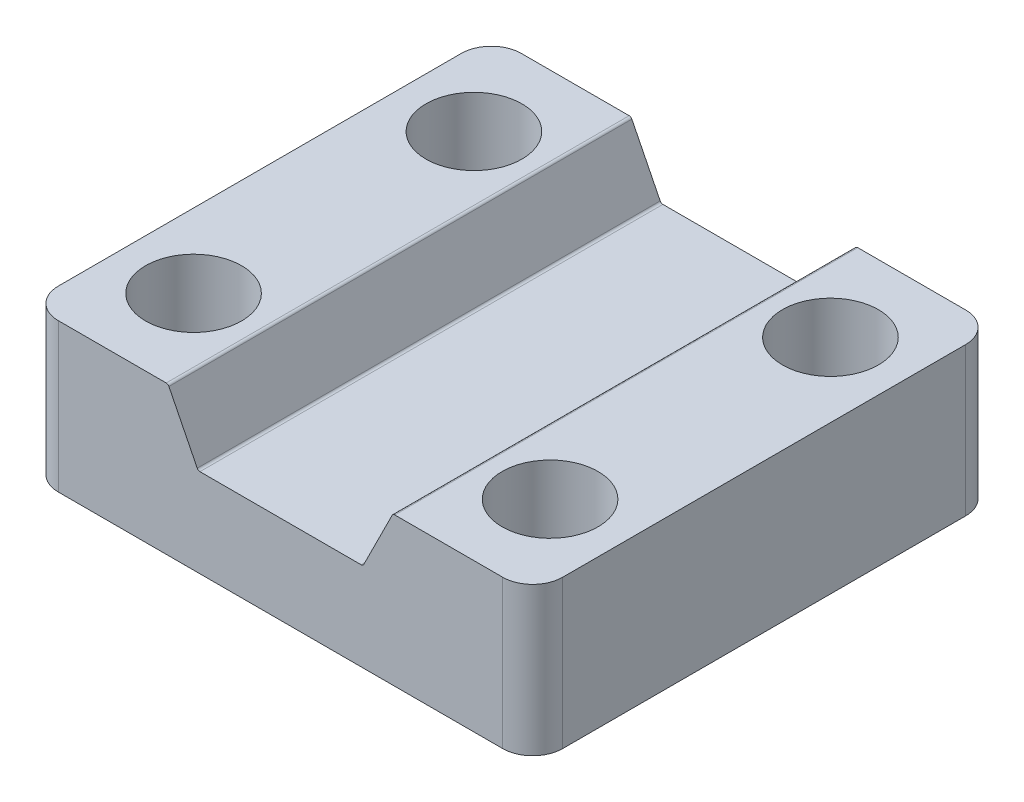
ISO-10303-21;
HEADER;
FILE_DESCRIPTION(('STEP AP214'),'2;1');
FILE_NAME('part.step','',(''),(''),'','','');
FILE_SCHEMA(('AUTOMOTIVE_DESIGN { 1 0 10303 214 1 1 1 1 }'));
ENDSEC;
DATA;
#1=APPLICATION_CONTEXT('core data for automotive mechanical design processes');
#2=APPLICATION_PROTOCOL_DEFINITION('international standard','automotive_design',2000,#1);
#3=PRODUCT_CONTEXT('',#1,'mechanical');
#4=PRODUCT('Part','Part','',(#3));
#5=PRODUCT_RELATED_PRODUCT_CATEGORY('part','',(#4));
#6=PRODUCT_DEFINITION_FORMATION('','',#4);
#7=PRODUCT_DEFINITION_CONTEXT('part definition',#1,'design');
#8=PRODUCT_DEFINITION('design','',#6,#7);
#9=PRODUCT_DEFINITION_SHAPE('','',#8);
#10=(LENGTH_UNIT() NAMED_UNIT(*) SI_UNIT(.MILLI.,.METRE.));
#11=(NAMED_UNIT(*) PLANE_ANGLE_UNIT() SI_UNIT($,.RADIAN.));
#12=(NAMED_UNIT(*) SI_UNIT($,.STERADIAN.) SOLID_ANGLE_UNIT());
#13=UNCERTAINTY_MEASURE_WITH_UNIT(LENGTH_MEASURE(1.E-05),#10,'distance_accuracy_value','');
#14=(GEOMETRIC_REPRESENTATION_CONTEXT(3) GLOBAL_UNCERTAINTY_ASSIGNED_CONTEXT((#13)) GLOBAL_UNIT_ASSIGNED_CONTEXT((#10,
#11,#12)) REPRESENTATION_CONTEXT('',''));
#15=CARTESIAN_POINT('',(0.,0.,0.));
#16=DIRECTION('',(0.,0.,1.));
#17=DIRECTION('',(1.,0.,0.));
#18=AXIS2_PLACEMENT_3D('',#15,#16,#17);
#19=CARTESIAN_POINT('',(0.,12.573,0.));
#20=DIRECTION('',(0.,1.,0.));
#21=DIRECTION('',(0.,0.,1.));
#22=AXIS2_PLACEMENT_3D('',#19,#20,#21);
#23=PLANE('',#22);
#24=DIRECTION('',(0.,0.,-1.));
#25=VECTOR('',#24,1.);
#26=CARTESIAN_POINT('',(21.3614,12.573,-19.6088));
#27=LINE('',#26,#25);
#28=CARTESIAN_POINT('',(21.3614,12.573,17.0688));
#29=VERTEX_POINT('',#28);
#30=CARTESIAN_POINT('',(21.3614,12.573,-17.0688));
#31=VERTEX_POINT('',#30);
#32=EDGE_CURVE('E251',#29,#31,#27,.T.);
#33=ORIENTED_EDGE('',*,*,#32,.T.);
#34=CARTESIAN_POINT('',(18.8214,12.573,-17.0688));
#35=DIRECTION('',(0.,1.,0.));
#36=DIRECTION('',(0.,0.,1.));
#37=AXIS2_PLACEMENT_3D('',#34,#35,#36);
#38=CIRCLE('',#37,2.54);
#39=CARTESIAN_POINT('',(18.8214,12.573,-19.6088));
#40=VERTEX_POINT('',#39);
#41=EDGE_CURVE('E227',#31,#40,#38,.T.);
#42=ORIENTED_EDGE('',*,*,#41,.T.);
#43=DIRECTION('',(-1.,0.,0.));
#44=VECTOR('',#43,1.);
#45=CARTESIAN_POINT('',(-21.3614,12.573,-19.6088));
#46=LINE('',#45,#44);
#47=CARTESIAN_POINT('',(9.68198063314247,12.573,-19.6088));
#48=VERTEX_POINT('',#47);
#49=EDGE_CURVE('E271',#40,#48,#46,.T.);
#50=ORIENTED_EDGE('',*,*,#49,.T.);
#51=DIRECTION('',(0.,0.,1.));
#52=VECTOR('',#51,1.);
#53=CARTESIAN_POINT('',(9.68198063314247,12.573,19.6088));
#54=LINE('',#53,#52);
#55=CARTESIAN_POINT('',(9.68198063314247,12.573,19.6088));
#56=VERTEX_POINT('',#55);
#57=EDGE_CURVE('E184',#48,#56,#54,.T.);
#58=ORIENTED_EDGE('',*,*,#57,.T.);
#59=DIRECTION('',(1.,0.,0.));
#60=VECTOR('',#59,1.);
#61=CARTESIAN_POINT('',(-21.3614,12.573,19.6088));
#62=LINE('',#61,#60);
#63=CARTESIAN_POINT('',(18.8214,12.573,19.6088));
#64=VERTEX_POINT('',#63);
#65=EDGE_CURVE('E294',#56,#64,#62,.T.);
#66=ORIENTED_EDGE('',*,*,#65,.T.);
#67=CARTESIAN_POINT('',(18.8214,12.573,17.0688));
#68=DIRECTION('',(0.,1.,0.));
#69=DIRECTION('',(0.,0.,1.));
#70=AXIS2_PLACEMENT_3D('',#67,#68,#69);
#71=CIRCLE('',#70,2.54);
#72=EDGE_CURVE('E225',#64,#29,#71,.T.);
#73=ORIENTED_EDGE('',*,*,#72,.T.);
#74=EDGE_LOOP('',(#33,#42,#50,#58,#66,#73));
#75=FACE_BOUND('',#74,.T.);
#76=CARTESIAN_POINT('',(15.1003,12.573,11.8745));
#77=DIRECTION('',(0.,1.,0.));
#78=DIRECTION('',(0.,0.,1.));
#79=AXIS2_PLACEMENT_3D('',#76,#77,#78);
#80=CIRCLE('',#79,4.06400000000002);
#81=CARTESIAN_POINT('',(15.1003,12.573,15.9385));
#82=VERTEX_POINT('',#81);
#83=EDGE_CURVE('E287',#82,#82,#80,.T.);
#84=ORIENTED_EDGE('',*,*,#83,.F.);
#85=EDGE_LOOP('',(#84));
#86=FACE_BOUND('',#85,.T.);
#87=CARTESIAN_POINT('',(15.1003,12.573,-11.8745));
#88=DIRECTION('',(0.,1.,0.));
#89=DIRECTION('',(0.,0.,1.));
#90=AXIS2_PLACEMENT_3D('',#87,#88,#89);
#91=CIRCLE('',#90,4.06400000000002);
#92=CARTESIAN_POINT('',(15.1003,12.573,-7.81049999999998));
#93=VERTEX_POINT('',#92);
#94=EDGE_CURVE('E302',#93,#93,#91,.T.);
#95=ORIENTED_EDGE('',*,*,#94,.F.);
#96=EDGE_LOOP('',(#95));
#97=FACE_BOUND('',#96,.T.);
#98=ADVANCED_FACE('F33',(#75,#86,#97),#23,.T.);
#99=CARTESIAN_POINT('',(-9.68198063314247,12.573,-19.6088));
#100=VERTEX_POINT('',#99);
#101=CARTESIAN_POINT('',(-18.8214,12.573,-19.6088));
#102=VERTEX_POINT('',#101);
#103=EDGE_CURVE('E255',#100,#102,#46,.T.);
#104=ORIENTED_EDGE('',*,*,#103,.T.);
#105=CARTESIAN_POINT('',(-18.8214,12.573,-17.0688));
#106=DIRECTION('',(0.,1.,0.));
#107=DIRECTION('',(0.,0.,1.));
#108=AXIS2_PLACEMENT_3D('',#105,#106,#107);
#109=CIRCLE('',#108,2.54);
#110=CARTESIAN_POINT('',(-21.3614,12.573,-17.0688));
#111=VERTEX_POINT('',#110);
#112=EDGE_CURVE('E234',#102,#111,#109,.T.);
#113=ORIENTED_EDGE('',*,*,#112,.T.);
#114=DIRECTION('',(0.,0.,1.));
#115=VECTOR('',#114,1.);
#116=CARTESIAN_POINT('',(-21.3614,12.573,-19.6088));
#117=LINE('',#116,#115);
#118=CARTESIAN_POINT('',(-21.3614,12.573,17.0688));
#119=VERTEX_POINT('',#118);
#120=EDGE_CURVE('E275',#111,#119,#117,.T.);
#121=ORIENTED_EDGE('',*,*,#120,.T.);
#122=CARTESIAN_POINT('',(-18.8214,12.573,17.0688));
#123=DIRECTION('',(0.,1.,0.));
#124=DIRECTION('',(0.,0.,1.));
#125=AXIS2_PLACEMENT_3D('',#122,#123,#124);
#126=CIRCLE('',#125,2.54);
#127=CARTESIAN_POINT('',(-18.8214,12.573,19.6088));
#128=VERTEX_POINT('',#127);
#129=EDGE_CURVE('E48',#119,#128,#126,.T.);
#130=ORIENTED_EDGE('',*,*,#129,.T.);
#131=CARTESIAN_POINT('',(-9.68198063314247,12.573,19.6088));
#132=VERTEX_POINT('',#131);
#133=EDGE_CURVE('E243',#128,#132,#62,.T.);
#134=ORIENTED_EDGE('',*,*,#133,.T.);
#135=DIRECTION('',(0.,0.,1.));
#136=VECTOR('',#135,1.);
#137=CARTESIAN_POINT('',(-9.68198063314247,12.573,-19.6088));
#138=LINE('',#137,#136);
#139=EDGE_CURVE('E201',#132,#100,#138,.F.);
#140=ORIENTED_EDGE('',*,*,#139,.T.);
#141=EDGE_LOOP('',(#104,#113,#121,#130,#134,#140));
#142=FACE_BOUND('',#141,.T.);
#143=CARTESIAN_POINT('',(-15.1003,12.573,-11.8745));
#144=DIRECTION('',(0.,1.,0.));
#145=DIRECTION('',(0.,0.,1.));
#146=AXIS2_PLACEMENT_3D('',#143,#144,#145);
#147=CIRCLE('',#146,4.06400000000002);
#148=CARTESIAN_POINT('',(-15.1003,12.573,-7.81049999999998));
#149=VERTEX_POINT('',#148);
#150=EDGE_CURVE('E297',#149,#149,#147,.T.);
#151=ORIENTED_EDGE('',*,*,#150,.F.);
#152=EDGE_LOOP('',(#151));
#153=FACE_BOUND('',#152,.T.);
#154=CARTESIAN_POINT('',(-15.1003,12.573,11.8745));
#155=DIRECTION('',(0.,1.,0.));
#156=DIRECTION('',(0.,0.,1.));
#157=AXIS2_PLACEMENT_3D('',#154,#155,#156);
#158=CIRCLE('',#157,4.06400000000002);
#159=CARTESIAN_POINT('',(-15.1003,12.573,15.9385));
#160=VERTEX_POINT('',#159);
#161=EDGE_CURVE('E308',#160,#160,#158,.T.);
#162=ORIENTED_EDGE('',*,*,#161,.F.);
#163=EDGE_LOOP('',(#162));
#164=FACE_BOUND('',#163,.T.);
#165=ADVANCED_FACE('F336',(#142,#153,#164),#23,.T.);
#166=CARTESIAN_POINT('',(0.,0.,0.));
#167=DIRECTION('',(0.,1.,0.));
#168=DIRECTION('',(0.,0.,1.));
#169=AXIS2_PLACEMENT_3D('',#166,#167,#168);
#170=PLANE('',#169);
#171=DIRECTION('',(-1.,0.,0.));
#172=VECTOR('',#171,1.);
#173=CARTESIAN_POINT('',(-21.3614,0.,-19.6088));
#174=LINE('',#173,#172);
#175=CARTESIAN_POINT('',(18.8214,0.,-19.6088));
#176=VERTEX_POINT('',#175);
#177=CARTESIAN_POINT('',(-18.8214,0.,-19.6088));
#178=VERTEX_POINT('',#177);
#179=EDGE_CURVE('E257',#176,#178,#174,.T.);
#180=ORIENTED_EDGE('',*,*,#179,.F.);
#181=CARTESIAN_POINT('',(18.8214,0.,-17.0688));
#182=DIRECTION('',(0.,1.,0.));
#183=DIRECTION('',(0.,0.,1.));
#184=AXIS2_PLACEMENT_3D('',#181,#182,#183);
#185=CIRCLE('',#184,2.54);
#186=CARTESIAN_POINT('',(21.3614,0.,-17.0688));
#187=VERTEX_POINT('',#186);
#188=EDGE_CURVE('E218',#176,#187,#185,.F.);
#189=ORIENTED_EDGE('',*,*,#188,.T.);
#190=DIRECTION('',(0.,0.,-1.));
#191=VECTOR('',#190,1.);
#192=CARTESIAN_POINT('',(21.3614,0.,-19.6088));
#193=LINE('',#192,#191);
#194=CARTESIAN_POINT('',(21.3614,0.,17.0688));
#195=VERTEX_POINT('',#194);
#196=EDGE_CURVE('E282',#195,#187,#193,.T.);
#197=ORIENTED_EDGE('',*,*,#196,.F.);
#198=CARTESIAN_POINT('',(18.8214,0.,17.0688));
#199=DIRECTION('',(0.,1.,0.));
#200=DIRECTION('',(0.,0.,1.));
#201=AXIS2_PLACEMENT_3D('',#198,#199,#200);
#202=CIRCLE('',#201,2.54);
#203=CARTESIAN_POINT('',(18.8214,0.,19.6088));
#204=VERTEX_POINT('',#203);
#205=EDGE_CURVE('E214',#195,#204,#202,.F.);
#206=ORIENTED_EDGE('',*,*,#205,.T.);
#207=DIRECTION('',(1.,0.,0.));
#208=VECTOR('',#207,1.);
#209=CARTESIAN_POINT('',(-21.3614,0.,19.6088));
#210=LINE('',#209,#208);
#211=CARTESIAN_POINT('',(-18.8214,0.,19.6088));
#212=VERTEX_POINT('',#211);
#213=EDGE_CURVE('E241',#212,#204,#210,.T.);
#214=ORIENTED_EDGE('',*,*,#213,.F.);
#215=CARTESIAN_POINT('',(-18.8214,0.,17.0688));
#216=DIRECTION('',(0.,1.,0.));
#217=DIRECTION('',(0.,0.,1.));
#218=AXIS2_PLACEMENT_3D('',#215,#216,#217);
#219=CIRCLE('',#218,2.54);
#220=CARTESIAN_POINT('',(-21.3614,0.,17.0688));
#221=VERTEX_POINT('',#220);
#222=EDGE_CURVE('E212',#212,#221,#219,.F.);
#223=ORIENTED_EDGE('',*,*,#222,.T.);
#224=DIRECTION('',(0.,0.,1.));
#225=VECTOR('',#224,1.);
#226=CARTESIAN_POINT('',(-21.3614,0.,-19.6088));
#227=LINE('',#226,#225);
#228=CARTESIAN_POINT('',(-21.3614,0.,-17.0688));
#229=VERTEX_POINT('',#228);
#230=EDGE_CURVE('E252',#229,#221,#227,.T.);
#231=ORIENTED_EDGE('',*,*,#230,.F.);
#232=CARTESIAN_POINT('',(-18.8214,0.,-17.0688));
#233=DIRECTION('',(0.,1.,0.));
#234=DIRECTION('',(0.,0.,1.));
#235=AXIS2_PLACEMENT_3D('',#232,#233,#234);
#236=CIRCLE('',#235,2.54);
#237=EDGE_CURVE('E216',#229,#178,#236,.F.);
#238=ORIENTED_EDGE('',*,*,#237,.T.);
#239=EDGE_LOOP('',(#180,#189,#197,#206,#214,#223,#231,#238));
#240=FACE_BOUND('',#239,.T.);
#241=CARTESIAN_POINT('',(15.1003,0.,11.8745));
#242=DIRECTION('',(0.,1.,0.));
#243=DIRECTION('',(0.,0.,1.));
#244=AXIS2_PLACEMENT_3D('',#241,#242,#243);
#245=CIRCLE('',#244,4.06400000000002);
#246=CARTESIAN_POINT('',(15.1003,0.,15.9385));
#247=VERTEX_POINT('',#246);
#248=EDGE_CURVE('E290',#247,#247,#245,.T.);
#249=ORIENTED_EDGE('',*,*,#248,.T.);
#250=EDGE_LOOP('',(#249));
#251=FACE_BOUND('',#250,.T.);
#252=CARTESIAN_POINT('',(-15.1003,0.,-11.8745));
#253=DIRECTION('',(0.,1.,0.));
#254=DIRECTION('',(0.,0.,1.));
#255=AXIS2_PLACEMENT_3D('',#252,#253,#254);
#256=CIRCLE('',#255,4.06400000000002);
#257=CARTESIAN_POINT('',(-15.1003,0.,-7.81049999999998));
#258=VERTEX_POINT('',#257);
#259=EDGE_CURVE('E299',#258,#258,#256,.T.);
#260=ORIENTED_EDGE('',*,*,#259,.T.);
#261=EDGE_LOOP('',(#260));
#262=FACE_BOUND('',#261,.T.);
#263=CARTESIAN_POINT('',(15.1003,0.,-11.8745));
#264=DIRECTION('',(0.,1.,0.));
#265=DIRECTION('',(0.,0.,1.));
#266=AXIS2_PLACEMENT_3D('',#263,#264,#265);
#267=CIRCLE('',#266,4.06400000000002);
#268=CARTESIAN_POINT('',(15.1003,0.,-7.81049999999998));
#269=VERTEX_POINT('',#268);
#270=EDGE_CURVE('E305',#269,#269,#267,.T.);
#271=ORIENTED_EDGE('',*,*,#270,.T.);
#272=EDGE_LOOP('',(#271));
#273=FACE_BOUND('',#272,.T.);
#274=CARTESIAN_POINT('',(-15.1003,0.,11.8745));
#275=DIRECTION('',(0.,1.,0.));
#276=DIRECTION('',(0.,0.,1.));
#277=AXIS2_PLACEMENT_3D('',#274,#275,#276);
#278=CIRCLE('',#277,4.06400000000002);
#279=CARTESIAN_POINT('',(-15.1003,0.,15.9385));
#280=VERTEX_POINT('',#279);
#281=EDGE_CURVE('E171',#280,#280,#278,.T.);
#282=ORIENTED_EDGE('',*,*,#281,.T.);
#283=EDGE_LOOP('',(#282));
#284=FACE_BOUND('',#283,.T.);
#285=ADVANCED_FACE('F247',(#240,#251,#262,#273,#284),#170,.F.);
#286=CARTESIAN_POINT('',(21.3614,12.573,-19.6088));
#287=DIRECTION('',(-1.,0.,0.));
#288=DIRECTION('',(0.,0.,1.));
#289=AXIS2_PLACEMENT_3D('',#286,#287,#288);
#290=PLANE('',#289);
#291=ORIENTED_EDGE('',*,*,#196,.T.);
#292=DIRECTION('',(0.,-1.,0.));
#293=VECTOR('',#292,1.);
#294=CARTESIAN_POINT('',(21.3614,12.573,-17.0688));
#295=LINE('',#294,#293);
#296=EDGE_CURVE('E223',#187,#31,#295,.F.);
#297=ORIENTED_EDGE('',*,*,#296,.T.);
#298=ORIENTED_EDGE('',*,*,#32,.F.);
#299=DIRECTION('',(0.,-1.,0.));
#300=VECTOR('',#299,1.);
#301=CARTESIAN_POINT('',(21.3614,12.573,17.0688));
#302=LINE('',#301,#300);
#303=EDGE_CURVE('E220',#29,#195,#302,.T.);
#304=ORIENTED_EDGE('',*,*,#303,.T.);
#305=EDGE_LOOP('',(#291,#297,#298,#304));
#306=FACE_BOUND('',#305,.T.);
#307=ADVANCED_FACE('F284',(#306),#290,.F.);
#308=CARTESIAN_POINT('',(-21.3614,12.573,-19.6088));
#309=DIRECTION('',(0.,0.,1.));
#310=DIRECTION('',(1.,0.,0.));
#311=AXIS2_PLACEMENT_3D('',#308,#309,#310);
#312=PLANE('',#311);
#313=ORIENTED_EDGE('',*,*,#49,.F.);
#314=DIRECTION('',(0.,-1.,0.));
#315=VECTOR('',#314,1.);
#316=CARTESIAN_POINT('',(18.8214,12.573,-19.6088));
#317=LINE('',#316,#315);
#318=EDGE_CURVE('E209',#40,#176,#317,.T.);
#319=ORIENTED_EDGE('',*,*,#318,.T.);
#320=ORIENTED_EDGE('',*,*,#179,.T.);
#321=DIRECTION('',(0.,-1.,0.));
#322=VECTOR('',#321,1.);
#323=CARTESIAN_POINT('',(-18.8214,12.573,-19.6088));
#324=LINE('',#323,#322);
#325=EDGE_CURVE('E207',#178,#102,#324,.F.);
#326=ORIENTED_EDGE('',*,*,#325,.T.);
#327=ORIENTED_EDGE('',*,*,#103,.F.);
#328=CARTESIAN_POINT('',(-9.68198063314247,12.319,-19.6088));
#329=DIRECTION('',(0.,0.,1.));
#330=DIRECTION('',(1.,0.,0.));
#331=AXIS2_PLACEMENT_3D('',#328,#329,#330);
#332=CIRCLE('',#331,0.254);
#333=CARTESIAN_POINT('',(-9.4547961266285,12.432592253257,-19.6088));
#334=VERTEX_POINT('',#333);
#335=EDGE_CURVE('E192',#100,#334,#332,.F.);
#336=ORIENTED_EDGE('',*,*,#335,.T.);
#337=DIRECTION('',(0.447213595499958,-0.894427190999916,0.));
#338=VECTOR('',#337,1.);
#339=CARTESIAN_POINT('',(-9.525,12.573,-19.6088));
#340=LINE('',#339,#338);
#341=CARTESIAN_POINT('',(-7.05520387337151,7.63340774674301,-19.6088));
#342=VERTEX_POINT('',#341);
#343=EDGE_CURVE('E316',#334,#342,#340,.T.);
#344=ORIENTED_EDGE('',*,*,#343,.T.);
#345=CARTESIAN_POINT('',(-6.82801936685753,7.747,-19.6088));
#346=DIRECTION('',(0.,0.,1.));
#347=DIRECTION('',(1.,0.,0.));
#348=AXIS2_PLACEMENT_3D('',#345,#346,#347);
#349=CIRCLE('',#348,0.254);
#350=CARTESIAN_POINT('',(-6.82801936685753,7.493,-19.6088));
#351=VERTEX_POINT('',#350);
#352=EDGE_CURVE('E205',#342,#351,#349,.T.);
#353=ORIENTED_EDGE('',*,*,#352,.T.);
#354=DIRECTION('',(1.,0.,0.));
#355=VECTOR('',#354,1.);
#356=CARTESIAN_POINT('',(-6.985,7.493,-19.6088));
#357=LINE('',#356,#355);
#358=CARTESIAN_POINT('',(6.82801936685753,7.493,-19.6088));
#359=VERTEX_POINT('',#358);
#360=EDGE_CURVE('E156',#351,#359,#357,.T.);
#361=ORIENTED_EDGE('',*,*,#360,.T.);
#362=CARTESIAN_POINT('',(6.82801936685753,7.747,-19.6088));
#363=DIRECTION('',(0.,0.,1.));
#364=DIRECTION('',(1.,0.,0.));
#365=AXIS2_PLACEMENT_3D('',#362,#363,#364);
#366=CIRCLE('',#365,0.254);
#367=CARTESIAN_POINT('',(7.05520387337151,7.63340774674301,-19.6088));
#368=VERTEX_POINT('',#367);
#369=EDGE_CURVE('E148',#359,#368,#366,.T.);
#370=ORIENTED_EDGE('',*,*,#369,.T.);
#371=DIRECTION('',(0.447213595499958,0.894427190999916,0.));
#372=VECTOR('',#371,1.);
#373=CARTESIAN_POINT('',(6.985,7.493,-19.6088));
#374=LINE('',#373,#372);
#375=CARTESIAN_POINT('',(9.45479612662849,12.432592253257,-19.6088));
#376=VERTEX_POINT('',#375);
#377=EDGE_CURVE('E153',#368,#376,#374,.T.);
#378=ORIENTED_EDGE('',*,*,#377,.T.);
#379=CARTESIAN_POINT('',(9.68198063314247,12.319,-19.6088));
#380=DIRECTION('',(0.,0.,1.));
#381=DIRECTION('',(1.,0.,0.));
#382=AXIS2_PLACEMENT_3D('',#379,#380,#381);
#383=CIRCLE('',#382,0.254);
#384=EDGE_CURVE('E194',#376,#48,#383,.F.);
#385=ORIENTED_EDGE('',*,*,#384,.T.);
#386=EDGE_LOOP('',(#313,#319,#320,#326,#327,#336,#344,#353,#361,#370,#378,#385));
#387=FACE_BOUND('',#386,.T.);
#388=ADVANCED_FACE('F151',(#387),#312,.F.);
#389=CARTESIAN_POINT('',(-21.3614,12.573,-19.6088));
#390=DIRECTION('',(1.,0.,0.));
#391=DIRECTION('',(0.,0.,-1.));
#392=AXIS2_PLACEMENT_3D('',#389,#390,#391);
#393=PLANE('',#392);
#394=ORIENTED_EDGE('',*,*,#120,.F.);
#395=DIRECTION('',(0.,-1.,0.));
#396=VECTOR('',#395,1.);
#397=CARTESIAN_POINT('',(-21.3614,12.573,-17.0688));
#398=LINE('',#397,#396);
#399=EDGE_CURVE('E230',#111,#229,#398,.T.);
#400=ORIENTED_EDGE('',*,*,#399,.T.);
#401=ORIENTED_EDGE('',*,*,#230,.T.);
#402=DIRECTION('',(0.,-1.,0.));
#403=VECTOR('',#402,1.);
#404=CARTESIAN_POINT('',(-21.3614,12.573,17.0688));
#405=LINE('',#404,#403);
#406=EDGE_CURVE('E56',#221,#119,#405,.F.);
#407=ORIENTED_EDGE('',*,*,#406,.T.);
#408=EDGE_LOOP('',(#394,#400,#401,#407));
#409=FACE_BOUND('',#408,.T.);
#410=ADVANCED_FACE('F343',(#409),#393,.F.);
#411=CARTESIAN_POINT('',(-21.3614,12.573,19.6088));
#412=DIRECTION('',(0.,0.,-1.));
#413=DIRECTION('',(-1.,0.,0.));
#414=AXIS2_PLACEMENT_3D('',#411,#412,#413);
#415=PLANE('',#414);
#416=ORIENTED_EDGE('',*,*,#213,.T.);
#417=DIRECTION('',(0.,-1.,0.));
#418=VECTOR('',#417,1.);
#419=CARTESIAN_POINT('',(18.8214,12.573,19.6088));
#420=LINE('',#419,#418);
#421=EDGE_CURVE('E11',#204,#64,#420,.F.);
#422=ORIENTED_EDGE('',*,*,#421,.T.);
#423=ORIENTED_EDGE('',*,*,#65,.F.);
#424=CARTESIAN_POINT('',(9.68198063314247,12.319,19.6088));
#425=DIRECTION('',(0.,0.,-1.));
#426=DIRECTION('',(-1.,0.,0.));
#427=AXIS2_PLACEMENT_3D('',#424,#425,#426);
#428=CIRCLE('',#427,0.254);
#429=CARTESIAN_POINT('',(9.4547961266285,12.432592253257,19.6088));
#430=VERTEX_POINT('',#429);
#431=EDGE_CURVE('E190',#56,#430,#428,.F.);
#432=ORIENTED_EDGE('',*,*,#431,.T.);
#433=DIRECTION('',(-0.447213595499958,-0.894427190999916,0.));
#434=VECTOR('',#433,1.);
#435=CARTESIAN_POINT('',(3.34772000000001,0.218439999999999,19.6088));
#436=LINE('',#435,#434);
#437=CARTESIAN_POINT('',(7.05520387337151,7.63340774674301,19.6088));
#438=VERTEX_POINT('',#437);
#439=EDGE_CURVE('E179',#430,#438,#436,.T.);
#440=ORIENTED_EDGE('',*,*,#439,.T.);
#441=CARTESIAN_POINT('',(6.82801936685753,7.747,19.6088));
#442=DIRECTION('',(0.,0.,-1.));
#443=DIRECTION('',(-1.,0.,0.));
#444=AXIS2_PLACEMENT_3D('',#441,#442,#443);
#445=CIRCLE('',#444,0.254);
#446=CARTESIAN_POINT('',(6.82801936685753,7.493,19.6088));
#447=VERTEX_POINT('',#446);
#448=EDGE_CURVE('E161',#438,#447,#445,.T.);
#449=ORIENTED_EDGE('',*,*,#448,.T.);
#450=DIRECTION('',(-1.,0.,0.));
#451=VECTOR('',#450,1.);
#452=CARTESIAN_POINT('',(-21.3614,7.493,19.6088));
#453=LINE('',#452,#451);
#454=CARTESIAN_POINT('',(-6.82801936685753,7.493,19.6088));
#455=VERTEX_POINT('',#454);
#456=EDGE_CURVE('E264',#447,#455,#453,.T.);
#457=ORIENTED_EDGE('',*,*,#456,.T.);
#458=CARTESIAN_POINT('',(-6.82801936685753,7.747,19.6088));
#459=DIRECTION('',(0.,0.,-1.));
#460=DIRECTION('',(-1.,0.,0.));
#461=AXIS2_PLACEMENT_3D('',#458,#459,#460);
#462=CIRCLE('',#461,0.254);
#463=CARTESIAN_POINT('',(-7.05520387337151,7.63340774674301,19.6088));
#464=VERTEX_POINT('',#463);
#465=EDGE_CURVE('E160',#455,#464,#462,.T.);
#466=ORIENTED_EDGE('',*,*,#465,.T.);
#467=DIRECTION('',(-0.447213595499958,0.894427190999916,0.));
#468=VECTOR('',#467,1.);
#469=CARTESIAN_POINT('',(-11.89228,17.30756,19.6088));
#470=LINE('',#469,#468);
#471=CARTESIAN_POINT('',(-9.45479612662849,12.432592253257,19.6088));
#472=VERTEX_POINT('',#471);
#473=EDGE_CURVE('E261',#464,#472,#470,.T.);
#474=ORIENTED_EDGE('',*,*,#473,.T.);
#475=CARTESIAN_POINT('',(-9.68198063314247,12.319,19.6088));
#476=DIRECTION('',(0.,0.,-1.));
#477=DIRECTION('',(-1.,0.,0.));
#478=AXIS2_PLACEMENT_3D('',#475,#476,#477);
#479=CIRCLE('',#478,0.254);
#480=EDGE_CURVE('E187',#472,#132,#479,.F.);
#481=ORIENTED_EDGE('',*,*,#480,.T.);
#482=ORIENTED_EDGE('',*,*,#133,.F.);
#483=DIRECTION('',(0.,-1.,0.));
#484=VECTOR('',#483,1.);
#485=CARTESIAN_POINT('',(-18.8214,12.573,19.6088));
#486=LINE('',#485,#484);
#487=EDGE_CURVE('E41',#128,#212,#486,.T.);
#488=ORIENTED_EDGE('',*,*,#487,.T.);
#489=EDGE_LOOP('',(#416,#422,#423,#432,#440,#449,#457,#466,#474,#481,#482,#488));
#490=FACE_BOUND('',#489,.T.);
#491=ADVANCED_FACE('F240',(#490),#415,.F.);
#492=CARTESIAN_POINT('',(15.1003,12.573,11.8745));
#493=DIRECTION('',(0.,-1.,0.));
#494=DIRECTION('',(0.,0.,-1.));
#495=AXIS2_PLACEMENT_3D('',#492,#493,#494);
#496=CYLINDRICAL_SURFACE('',#495,4.06400000000002);
#497=ORIENTED_EDGE('',*,*,#83,.T.);
#498=EDGE_LOOP('',(#497));
#499=FACE_BOUND('',#498,.T.);
#500=ORIENTED_EDGE('',*,*,#248,.F.);
#501=EDGE_LOOP('',(#500));
#502=FACE_BOUND('',#501,.T.);
#503=ADVANCED_FACE('F358',(#499,#502),#496,.F.);
#504=CARTESIAN_POINT('',(-15.1003,12.573,-11.8745));
#505=DIRECTION('',(0.,-1.,0.));
#506=DIRECTION('',(0.,0.,-1.));
#507=AXIS2_PLACEMENT_3D('',#504,#505,#506);
#508=CYLINDRICAL_SURFACE('',#507,4.06400000000002);
#509=ORIENTED_EDGE('',*,*,#150,.T.);
#510=EDGE_LOOP('',(#509));
#511=FACE_BOUND('',#510,.T.);
#512=ORIENTED_EDGE('',*,*,#259,.F.);
#513=EDGE_LOOP('',(#512));
#514=FACE_BOUND('',#513,.T.);
#515=ADVANCED_FACE('F466',(#511,#514),#508,.F.);
#516=CARTESIAN_POINT('',(15.1003,12.573,-11.8745));
#517=DIRECTION('',(0.,-1.,0.));
#518=DIRECTION('',(0.,0.,-1.));
#519=AXIS2_PLACEMENT_3D('',#516,#517,#518);
#520=CYLINDRICAL_SURFACE('',#519,4.06400000000002);
#521=ORIENTED_EDGE('',*,*,#94,.T.);
#522=EDGE_LOOP('',(#521));
#523=FACE_BOUND('',#522,.T.);
#524=ORIENTED_EDGE('',*,*,#270,.F.);
#525=EDGE_LOOP('',(#524));
#526=FACE_BOUND('',#525,.T.);
#527=ADVANCED_FACE('F457',(#523,#526),#520,.F.);
#528=CARTESIAN_POINT('',(-15.1003,12.573,11.8745));
#529=DIRECTION('',(0.,-1.,0.));
#530=DIRECTION('',(0.,0.,-1.));
#531=AXIS2_PLACEMENT_3D('',#528,#529,#530);
#532=CYLINDRICAL_SURFACE('',#531,4.06400000000002);
#533=ORIENTED_EDGE('',*,*,#161,.T.);
#534=EDGE_LOOP('',(#533));
#535=FACE_BOUND('',#534,.T.);
#536=ORIENTED_EDGE('',*,*,#281,.F.);
#537=EDGE_LOOP('',(#536));
#538=FACE_BOUND('',#537,.T.);
#539=ADVANCED_FACE('F444',(#535,#538),#532,.F.);
#540=CARTESIAN_POINT('',(6.985,7.493,-19.6088));
#541=DIRECTION('',(0.894427190999916,-0.447213595499958,0.));
#542=DIRECTION('',(0.447213595499958,0.894427190999916,0.));
#543=AXIS2_PLACEMENT_3D('',#540,#541,#542);
#544=PLANE('',#543);
#545=ORIENTED_EDGE('',*,*,#377,.F.);
#546=DIRECTION('',(0.,0.,1.));
#547=VECTOR('',#546,1.);
#548=CARTESIAN_POINT('',(7.05520387337151,7.63340774674301,19.6088));
#549=LINE('',#548,#547);
#550=EDGE_CURVE('E167',#368,#438,#549,.T.);
#551=ORIENTED_EDGE('',*,*,#550,.T.);
#552=ORIENTED_EDGE('',*,*,#439,.F.);
#553=DIRECTION('',(0.,0.,1.));
#554=VECTOR('',#553,1.);
#555=CARTESIAN_POINT('',(9.45479612662849,12.432592253257,-19.6088));
#556=LINE('',#555,#554);
#557=EDGE_CURVE('E170',#430,#376,#556,.F.);
#558=ORIENTED_EDGE('',*,*,#557,.T.);
#559=EDGE_LOOP('',(#545,#551,#552,#558));
#560=FACE_BOUND('',#559,.T.);
#561=ADVANCED_FACE('F165',(#560),#544,.F.);
#562=CARTESIAN_POINT('',(-6.985,7.493,-19.6088));
#563=DIRECTION('',(0.,-1.,0.));
#564=DIRECTION('',(0.,0.,-1.));
#565=AXIS2_PLACEMENT_3D('',#562,#563,#564);
#566=PLANE('',#565);
#567=ORIENTED_EDGE('',*,*,#456,.F.);
#568=DIRECTION('',(0.,0.,1.));
#569=VECTOR('',#568,1.);
#570=CARTESIAN_POINT('',(6.82801936685753,7.493,-19.6088));
#571=LINE('',#570,#569);
#572=EDGE_CURVE('E177',#447,#359,#571,.F.);
#573=ORIENTED_EDGE('',*,*,#572,.T.);
#574=ORIENTED_EDGE('',*,*,#360,.F.);
#575=DIRECTION('',(0.,0.,1.));
#576=VECTOR('',#575,1.);
#577=CARTESIAN_POINT('',(-6.82801936685753,7.493,19.6088));
#578=LINE('',#577,#576);
#579=EDGE_CURVE('E174',#351,#455,#578,.T.);
#580=ORIENTED_EDGE('',*,*,#579,.T.);
#581=EDGE_LOOP('',(#567,#573,#574,#580));
#582=FACE_BOUND('',#581,.T.);
#583=ADVANCED_FACE('F329',(#582),#566,.F.);
#584=CARTESIAN_POINT('',(-9.525,12.573,-19.6088));
#585=DIRECTION('',(-0.894427190999916,-0.447213595499958,0.));
#586=DIRECTION('',(0.447213595499958,-0.894427190999916,0.));
#587=AXIS2_PLACEMENT_3D('',#584,#585,#586);
#588=PLANE('',#587);
#589=ORIENTED_EDGE('',*,*,#473,.F.);
#590=DIRECTION('',(0.,0.,1.));
#591=VECTOR('',#590,1.);
#592=CARTESIAN_POINT('',(-7.05520387337151,7.63340774674301,-19.6088));
#593=LINE('',#592,#591);
#594=EDGE_CURVE('E199',#464,#342,#593,.F.);
#595=ORIENTED_EDGE('',*,*,#594,.T.);
#596=ORIENTED_EDGE('',*,*,#343,.F.);
#597=DIRECTION('',(0.,0.,1.));
#598=VECTOR('',#597,1.);
#599=CARTESIAN_POINT('',(-9.4547961266285,12.432592253257,19.6088));
#600=LINE('',#599,#598);
#601=EDGE_CURVE('E196',#334,#472,#600,.T.);
#602=ORIENTED_EDGE('',*,*,#601,.T.);
#603=EDGE_LOOP('',(#589,#595,#596,#602));
#604=FACE_BOUND('',#603,.T.);
#605=ADVANCED_FACE('F331',(#604),#588,.F.);
#606=CARTESIAN_POINT('',(6.82801936685753,7.747,-19.6088));
#607=DIRECTION('',(0.,0.,-1.));
#608=DIRECTION('',(-1.,0.,0.));
#609=AXIS2_PLACEMENT_3D('',#606,#607,#608);
#610=CYLINDRICAL_SURFACE('',#609,0.254);
#611=ORIENTED_EDGE('',*,*,#369,.F.);
#612=ORIENTED_EDGE('',*,*,#572,.F.);
#613=ORIENTED_EDGE('',*,*,#448,.F.);
#614=ORIENTED_EDGE('',*,*,#550,.F.);
#615=EDGE_LOOP('',(#611,#612,#613,#614));
#616=FACE_BOUND('',#615,.T.);
#617=ADVANCED_FACE('F173',(#616),#610,.F.);
#618=CARTESIAN_POINT('',(9.68198063314247,12.319,0.));
#619=DIRECTION('',(0.,0.,-1.));
#620=DIRECTION('',(-1.,0.,0.));
#621=AXIS2_PLACEMENT_3D('',#618,#619,#620);
#622=CYLINDRICAL_SURFACE('',#621,0.254);
#623=ORIENTED_EDGE('',*,*,#384,.F.);
#624=ORIENTED_EDGE('',*,*,#557,.F.);
#625=ORIENTED_EDGE('',*,*,#431,.F.);
#626=ORIENTED_EDGE('',*,*,#57,.F.);
#627=EDGE_LOOP('',(#623,#624,#625,#626));
#628=FACE_BOUND('',#627,.T.);
#629=ADVANCED_FACE('F269',(#628),#622,.T.);
#630=CARTESIAN_POINT('',(-6.82801936685753,7.747,-19.6088));
#631=DIRECTION('',(0.,0.,-1.));
#632=DIRECTION('',(-1.,0.,0.));
#633=AXIS2_PLACEMENT_3D('',#630,#631,#632);
#634=CYLINDRICAL_SURFACE('',#633,0.254);
#635=ORIENTED_EDGE('',*,*,#352,.F.);
#636=ORIENTED_EDGE('',*,*,#594,.F.);
#637=ORIENTED_EDGE('',*,*,#465,.F.);
#638=ORIENTED_EDGE('',*,*,#579,.F.);
#639=EDGE_LOOP('',(#635,#636,#637,#638));
#640=FACE_BOUND('',#639,.T.);
#641=ADVANCED_FACE('F327',(#640),#634,.F.);
#642=CARTESIAN_POINT('',(-9.68198063314247,12.319,-19.6088));
#643=DIRECTION('',(0.,0.,-1.));
#644=DIRECTION('',(-1.,0.,0.));
#645=AXIS2_PLACEMENT_3D('',#642,#643,#644);
#646=CYLINDRICAL_SURFACE('',#645,0.254);
#647=ORIENTED_EDGE('',*,*,#335,.F.);
#648=ORIENTED_EDGE('',*,*,#139,.F.);
#649=ORIENTED_EDGE('',*,*,#480,.F.);
#650=ORIENTED_EDGE('',*,*,#601,.F.);
#651=EDGE_LOOP('',(#647,#648,#649,#650));
#652=FACE_BOUND('',#651,.T.);
#653=ADVANCED_FACE('F333',(#652),#646,.T.);
#654=CARTESIAN_POINT('',(18.8214,12.573,-17.0688));
#655=DIRECTION('',(0.,-1.,0.));
#656=DIRECTION('',(0.,0.,-1.));
#657=AXIS2_PLACEMENT_3D('',#654,#655,#656);
#658=CYLINDRICAL_SURFACE('',#657,2.54);
#659=ORIENTED_EDGE('',*,*,#41,.F.);
#660=ORIENTED_EDGE('',*,*,#296,.F.);
#661=ORIENTED_EDGE('',*,*,#188,.F.);
#662=ORIENTED_EDGE('',*,*,#318,.F.);
#663=EDGE_LOOP('',(#659,#660,#661,#662));
#664=FACE_BOUND('',#663,.T.);
#665=ADVANCED_FACE('F279',(#664),#658,.T.);
#666=CARTESIAN_POINT('',(-18.8214,12.573,-17.0688));
#667=DIRECTION('',(0.,-1.,0.));
#668=DIRECTION('',(0.,0.,-1.));
#669=AXIS2_PLACEMENT_3D('',#666,#667,#668);
#670=CYLINDRICAL_SURFACE('',#669,2.54);
#671=ORIENTED_EDGE('',*,*,#112,.F.);
#672=ORIENTED_EDGE('',*,*,#325,.F.);
#673=ORIENTED_EDGE('',*,*,#237,.F.);
#674=ORIENTED_EDGE('',*,*,#399,.F.);
#675=EDGE_LOOP('',(#671,#672,#673,#674));
#676=FACE_BOUND('',#675,.T.);
#677=ADVANCED_FACE('F341',(#676),#670,.T.);
#678=CARTESIAN_POINT('',(18.8214,12.573,17.0688));
#679=DIRECTION('',(0.,-1.,0.));
#680=DIRECTION('',(0.,0.,-1.));
#681=AXIS2_PLACEMENT_3D('',#678,#679,#680);
#682=CYLINDRICAL_SURFACE('',#681,2.54);
#683=ORIENTED_EDGE('',*,*,#72,.F.);
#684=ORIENTED_EDGE('',*,*,#421,.F.);
#685=ORIENTED_EDGE('',*,*,#205,.F.);
#686=ORIENTED_EDGE('',*,*,#303,.F.);
#687=EDGE_LOOP('',(#683,#684,#685,#686));
#688=FACE_BOUND('',#687,.T.);
#689=ADVANCED_FACE('F345',(#688),#682,.T.);
#690=CARTESIAN_POINT('',(-18.8214,12.573,17.0688));
#691=DIRECTION('',(0.,-1.,0.));
#692=DIRECTION('',(0.,0.,-1.));
#693=AXIS2_PLACEMENT_3D('',#690,#691,#692);
#694=CYLINDRICAL_SURFACE('',#693,2.54);
#695=ORIENTED_EDGE('',*,*,#129,.F.);
#696=ORIENTED_EDGE('',*,*,#406,.F.);
#697=ORIENTED_EDGE('',*,*,#222,.F.);
#698=ORIENTED_EDGE('',*,*,#487,.F.);
#699=EDGE_LOOP('',(#695,#696,#697,#698));
#700=FACE_BOUND('',#699,.T.);
#701=ADVANCED_FACE('F35',(#700),#694,.T.);
#702=CLOSED_SHELL('',(#98,#165,#285,#307,#388,#410,#491,#503,#515,#527,#539,#561,#583,#605,#617,
#629,#641,#653,#665,#677,#689,#701));
#703=MANIFOLD_SOLID_BREP('B2',#702);
#704=ADVANCED_BREP_SHAPE_REPRESENTATION('',(#18,#703),#14);
#705=SHAPE_DEFINITION_REPRESENTATION(#9,#704);
ENDSEC;
END-ISO-10303-21;
